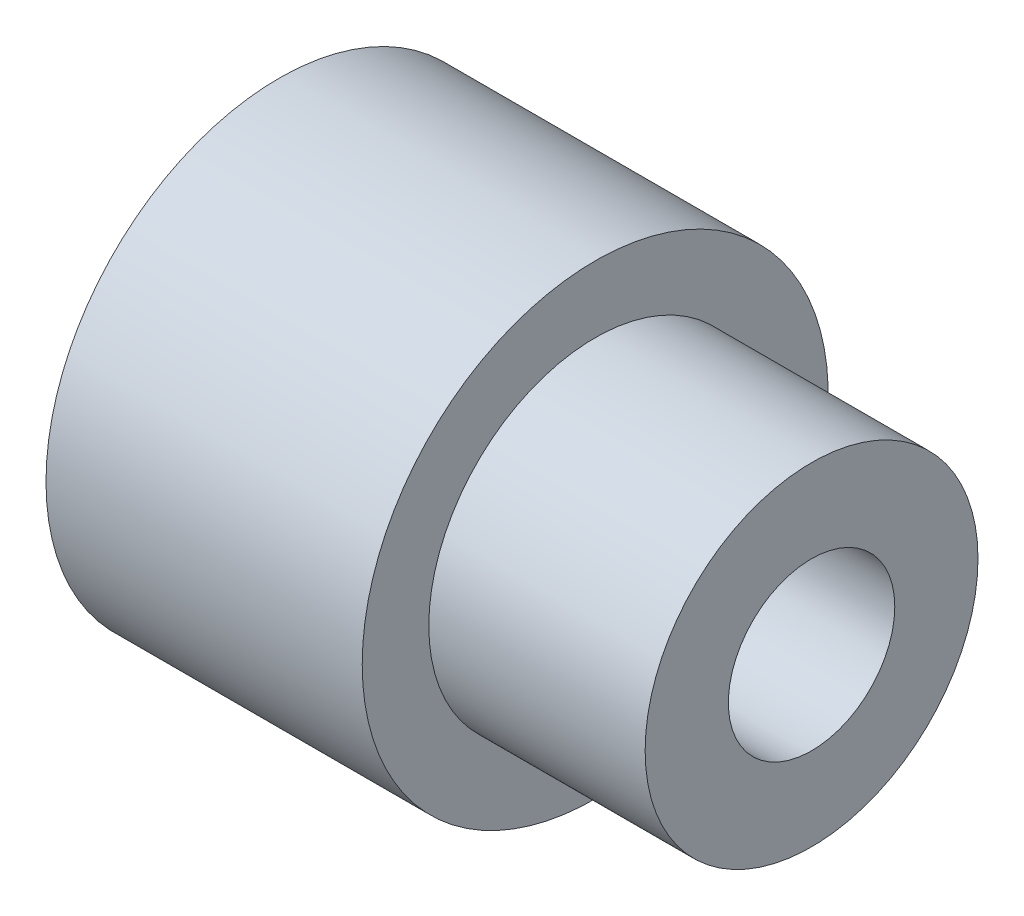
ISO-10303-21;
HEADER;
FILE_DESCRIPTION(('STEP AP214'),'2;1');
FILE_NAME('part.step','',(''),(''),'','','');
FILE_SCHEMA(('AUTOMOTIVE_DESIGN { 1 0 10303 214 1 1 1 1 }'));
ENDSEC;
DATA;
#1=APPLICATION_CONTEXT('core data for automotive mechanical design processes');
#2=APPLICATION_PROTOCOL_DEFINITION('international standard','automotive_design',2000,#1);
#3=PRODUCT_CONTEXT('',#1,'mechanical');
#4=PRODUCT('Part','Part','',(#3));
#5=PRODUCT_RELATED_PRODUCT_CATEGORY('part','',(#4));
#6=PRODUCT_DEFINITION_FORMATION('','',#4);
#7=PRODUCT_DEFINITION_CONTEXT('part definition',#1,'design');
#8=PRODUCT_DEFINITION('design','',#6,#7);
#9=PRODUCT_DEFINITION_SHAPE('','',#8);
#10=(LENGTH_UNIT() NAMED_UNIT(*) SI_UNIT(.MILLI.,.METRE.));
#11=(NAMED_UNIT(*) PLANE_ANGLE_UNIT() SI_UNIT($,.RADIAN.));
#12=(NAMED_UNIT(*) SI_UNIT($,.STERADIAN.) SOLID_ANGLE_UNIT());
#13=UNCERTAINTY_MEASURE_WITH_UNIT(LENGTH_MEASURE(1.E-05),#10,'distance_accuracy_value','');
#14=(GEOMETRIC_REPRESENTATION_CONTEXT(3) GLOBAL_UNCERTAINTY_ASSIGNED_CONTEXT((#13)) GLOBAL_UNIT_ASSIGNED_CONTEXT((#10,
#11,#12)) REPRESENTATION_CONTEXT('',''));
#15=CARTESIAN_POINT('',(0.,0.,0.));
#16=DIRECTION('',(0.,0.,1.));
#17=DIRECTION('',(1.,0.,0.));
#18=AXIS2_PLACEMENT_3D('',#15,#16,#17);
#19=CARTESIAN_POINT('',(-20.8099128746631,0.,0.));
#20=DIRECTION('',(-1.,0.,0.));
#21=DIRECTION('',(0.,0.,1.));
#22=AXIS2_PLACEMENT_3D('',#19,#20,#21);
#23=PLANE('',#22);
#24=CARTESIAN_POINT('',(-20.8099128746631,0.,0.));
#25=DIRECTION('',(-1.,0.,0.));
#26=DIRECTION('',(0.,0.,1.));
#27=AXIS2_PLACEMENT_3D('',#24,#25,#26);
#28=CIRCLE('',#27,11.);
#29=CARTESIAN_POINT('',(-20.8099128746631,0.,11.));
#30=VERTEX_POINT('',#29);
#31=EDGE_CURVE('E63',#30,#30,#28,.T.);
#32=ORIENTED_EDGE('',*,*,#31,.F.);
#33=EDGE_LOOP('',(#32));
#34=FACE_BOUND('',#33,.T.);
#35=CARTESIAN_POINT('',(-20.8099128746631,0.,0.));
#36=DIRECTION('',(-1.,0.,0.));
#37=DIRECTION('',(0.,0.,1.));
#38=AXIS2_PLACEMENT_3D('',#35,#36,#37);
#39=CIRCLE('',#38,14.);
#40=CARTESIAN_POINT('',(-20.8099128746631,0.,14.));
#41=VERTEX_POINT('',#40);
#42=EDGE_CURVE('E10',#41,#41,#39,.T.);
#43=ORIENTED_EDGE('',*,*,#42,.T.);
#44=EDGE_LOOP('',(#43));
#45=FACE_BOUND('',#44,.T.);
#46=ADVANCED_FACE('F43',(#34,#45),#23,.T.);
#47=CARTESIAN_POINT('',(-20.8099128746631,0.,0.));
#48=DIRECTION('',(-1.,0.,0.));
#49=DIRECTION('',(0.,0.,1.));
#50=AXIS2_PLACEMENT_3D('',#47,#48,#49);
#51=CYLINDRICAL_SURFACE('',#50,14.);
#52=CARTESIAN_POINT('',(-1.80991287466313,0.,0.));
#53=DIRECTION('',(-1.,0.,0.));
#54=DIRECTION('',(0.,0.,1.));
#55=AXIS2_PLACEMENT_3D('',#52,#53,#54);
#56=CIRCLE('',#55,14.);
#57=CARTESIAN_POINT('',(-1.80991287466313,0.,14.));
#58=VERTEX_POINT('',#57);
#59=EDGE_CURVE('E50',#58,#58,#56,.T.);
#60=ORIENTED_EDGE('',*,*,#59,.T.);
#61=EDGE_LOOP('',(#60));
#62=FACE_BOUND('',#61,.T.);
#63=ORIENTED_EDGE('',*,*,#42,.F.);
#64=EDGE_LOOP('',(#63));
#65=FACE_BOUND('',#64,.T.);
#66=ADVANCED_FACE('F109',(#62,#65),#51,.T.);
#67=CARTESIAN_POINT('',(-1.80991287466313,-14.,0.));
#68=DIRECTION('',(1.,0.,0.));
#69=DIRECTION('',(0.,0.,-1.));
#70=AXIS2_PLACEMENT_3D('',#67,#68,#69);
#71=PLANE('',#70);
#72=CARTESIAN_POINT('',(-1.80991287466313,0.,0.));
#73=DIRECTION('',(-1.,0.,0.));
#74=DIRECTION('',(0.,0.,1.));
#75=AXIS2_PLACEMENT_3D('',#72,#73,#74);
#76=CIRCLE('',#75,10.);
#77=CARTESIAN_POINT('',(-1.80991287466313,0.,10.));
#78=VERTEX_POINT('',#77);
#79=EDGE_CURVE('E54',#78,#78,#76,.T.);
#80=ORIENTED_EDGE('',*,*,#79,.T.);
#81=EDGE_LOOP('',(#80));
#82=FACE_BOUND('',#81,.T.);
#83=ORIENTED_EDGE('',*,*,#59,.F.);
#84=EDGE_LOOP('',(#83));
#85=FACE_BOUND('',#84,.T.);
#86=ADVANCED_FACE('F113',(#82,#85),#71,.T.);
#87=CARTESIAN_POINT('',(-20.8099128746631,0.,0.));
#88=DIRECTION('',(-1.,0.,0.));
#89=DIRECTION('',(0.,0.,1.));
#90=AXIS2_PLACEMENT_3D('',#87,#88,#89);
#91=CYLINDRICAL_SURFACE('',#90,10.);
#92=CARTESIAN_POINT('',(11.1900871253369,0.,0.));
#93=DIRECTION('',(-1.,0.,0.));
#94=DIRECTION('',(0.,0.,1.));
#95=AXIS2_PLACEMENT_3D('',#92,#93,#94);
#96=CIRCLE('',#95,10.);
#97=CARTESIAN_POINT('',(11.1900871253369,0.,10.));
#98=VERTEX_POINT('',#97);
#99=EDGE_CURVE('E59',#98,#98,#96,.T.);
#100=ORIENTED_EDGE('',*,*,#99,.T.);
#101=EDGE_LOOP('',(#100));
#102=FACE_BOUND('',#101,.T.);
#103=ORIENTED_EDGE('',*,*,#79,.F.);
#104=EDGE_LOOP('',(#103));
#105=FACE_BOUND('',#104,.T.);
#106=ADVANCED_FACE('F118',(#102,#105),#91,.T.);
#107=CARTESIAN_POINT('',(11.1900871253369,-10.,0.));
#108=DIRECTION('',(1.,0.,0.));
#109=DIRECTION('',(0.,0.,-1.));
#110=AXIS2_PLACEMENT_3D('',#107,#108,#109);
#111=PLANE('',#110);
#112=CARTESIAN_POINT('',(11.1900871253369,0.,0.));
#113=DIRECTION('',(1.,0.,0.));
#114=DIRECTION('',(0.,0.,-1.));
#115=AXIS2_PLACEMENT_3D('',#112,#113,#114);
#116=CIRCLE('',#115,5.);
#117=CARTESIAN_POINT('',(11.1900871253369,0.,-5.));
#118=VERTEX_POINT('',#117);
#119=EDGE_CURVE('E72',#118,#118,#116,.T.);
#120=ORIENTED_EDGE('',*,*,#119,.F.);
#121=EDGE_LOOP('',(#120));
#122=FACE_BOUND('',#121,.T.);
#123=ORIENTED_EDGE('',*,*,#99,.F.);
#124=EDGE_LOOP('',(#123));
#125=FACE_BOUND('',#124,.T.);
#126=ADVANCED_FACE('F104',(#122,#125),#111,.T.);
#127=CARTESIAN_POINT('',(-14.8099128746631,0.,0.));
#128=DIRECTION('',(-1.,0.,0.));
#129=DIRECTION('',(0.,0.,1.));
#130=AXIS2_PLACEMENT_3D('',#127,#128,#129);
#131=CYLINDRICAL_SURFACE('',#130,11.);
#132=CARTESIAN_POINT('',(-14.8099128746631,0.,0.));
#133=DIRECTION('',(-1.,0.,0.));
#134=DIRECTION('',(0.,0.,1.));
#135=AXIS2_PLACEMENT_3D('',#132,#133,#134);
#136=CIRCLE('',#135,11.);
#137=CARTESIAN_POINT('',(-14.8099128746631,0.,11.));
#138=VERTEX_POINT('',#137);
#139=EDGE_CURVE('E62',#138,#138,#136,.T.);
#140=ORIENTED_EDGE('',*,*,#139,.F.);
#141=EDGE_LOOP('',(#140));
#142=FACE_BOUND('',#141,.T.);
#143=ORIENTED_EDGE('',*,*,#31,.T.);
#144=EDGE_LOOP('',(#143));
#145=FACE_BOUND('',#144,.T.);
#146=ADVANCED_FACE('F98',(#142,#145),#131,.F.);
#147=CARTESIAN_POINT('',(-14.8099128746631,0.,0.));
#148=DIRECTION('',(-1.,0.,0.));
#149=DIRECTION('',(0.,0.,1.));
#150=AXIS2_PLACEMENT_3D('',#147,#148,#149);
#151=PLANE('',#150);
#152=CARTESIAN_POINT('',(-14.8099128746631,0.,0.));
#153=DIRECTION('',(-1.,0.,0.));
#154=DIRECTION('',(0.,0.,1.));
#155=AXIS2_PLACEMENT_3D('',#152,#153,#154);
#156=CIRCLE('',#155,9.);
#157=CARTESIAN_POINT('',(-14.8099128746631,0.,9.));
#158=VERTEX_POINT('',#157);
#159=EDGE_CURVE('E69',#158,#158,#156,.T.);
#160=ORIENTED_EDGE('',*,*,#159,.F.);
#161=EDGE_LOOP('',(#160));
#162=FACE_BOUND('',#161,.T.);
#163=ORIENTED_EDGE('',*,*,#139,.T.);
#164=EDGE_LOOP('',(#163));
#165=FACE_BOUND('',#164,.T.);
#166=ADVANCED_FACE('F92',(#162,#165),#151,.T.);
#167=CARTESIAN_POINT('',(-4.80991287466313,0.,0.));
#168=DIRECTION('',(-1.,0.,0.));
#169=DIRECTION('',(0.,0.,1.));
#170=AXIS2_PLACEMENT_3D('',#167,#168,#169);
#171=CYLINDRICAL_SURFACE('',#170,9.);
#172=CARTESIAN_POINT('',(-4.80991287466313,0.,0.));
#173=DIRECTION('',(-1.,0.,0.));
#174=DIRECTION('',(0.,0.,1.));
#175=AXIS2_PLACEMENT_3D('',#172,#173,#174);
#176=CIRCLE('',#175,9.);
#177=CARTESIAN_POINT('',(-4.80991287466313,0.,9.));
#178=VERTEX_POINT('',#177);
#179=EDGE_CURVE('E66',#178,#178,#176,.T.);
#180=ORIENTED_EDGE('',*,*,#179,.F.);
#181=EDGE_LOOP('',(#180));
#182=FACE_BOUND('',#181,.T.);
#183=ORIENTED_EDGE('',*,*,#159,.T.);
#184=EDGE_LOOP('',(#183));
#185=FACE_BOUND('',#184,.T.);
#186=ADVANCED_FACE('F86',(#182,#185),#171,.F.);
#187=CARTESIAN_POINT('',(-4.80991287466313,0.,0.));
#188=DIRECTION('',(-1.,0.,0.));
#189=DIRECTION('',(0.,0.,1.));
#190=AXIS2_PLACEMENT_3D('',#187,#188,#189);
#191=PLANE('',#190);
#192=CARTESIAN_POINT('',(-4.80991287466313,0.,0.));
#193=DIRECTION('',(-1.,0.,0.));
#194=DIRECTION('',(0.,0.,1.));
#195=AXIS2_PLACEMENT_3D('',#192,#193,#194);
#196=CIRCLE('',#195,5.);
#197=CARTESIAN_POINT('',(-4.80991287466313,0.,5.));
#198=VERTEX_POINT('',#197);
#199=EDGE_CURVE('E46',#198,#198,#196,.T.);
#200=ORIENTED_EDGE('',*,*,#199,.F.);
#201=EDGE_LOOP('',(#200));
#202=FACE_BOUND('',#201,.T.);
#203=ORIENTED_EDGE('',*,*,#179,.T.);
#204=EDGE_LOOP('',(#203));
#205=FACE_BOUND('',#204,.T.);
#206=ADVANCED_FACE('F83',(#202,#205),#191,.T.);
#207=CARTESIAN_POINT('',(-20.8099128746631,0.,0.));
#208=DIRECTION('',(1.,0.,0.));
#209=DIRECTION('',(0.,0.,-1.));
#210=AXIS2_PLACEMENT_3D('',#207,#208,#209);
#211=CYLINDRICAL_SURFACE('',#210,5.);
#212=ORIENTED_EDGE('',*,*,#119,.T.);
#213=EDGE_LOOP('',(#212));
#214=FACE_BOUND('',#213,.T.);
#215=ORIENTED_EDGE('',*,*,#199,.T.);
#216=EDGE_LOOP('',(#215));
#217=FACE_BOUND('',#216,.T.);
#218=ADVANCED_FACE('F81',(#214,#217),#211,.F.);
#219=CLOSED_SHELL('',(#46,#66,#86,#106,#126,#146,#166,#186,#206,#218));
#220=MANIFOLD_SOLID_BREP('B2',#219);
#221=ADVANCED_BREP_SHAPE_REPRESENTATION('',(#18,#220),#14);
#222=SHAPE_DEFINITION_REPRESENTATION(#9,#221);
ENDSEC;
END-ISO-10303-21;
